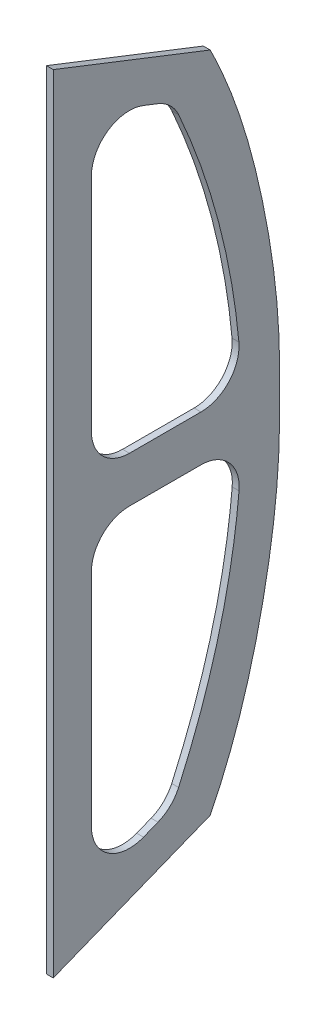
ISO-10303-21;
HEADER;
FILE_DESCRIPTION(('STEP AP214'),'2;1');
FILE_NAME('part.step','',(''),(''),'','','');
FILE_SCHEMA(('AUTOMOTIVE_DESIGN { 1 0 10303 214 1 1 1 1 }'));
ENDSEC;
DATA;
#1=APPLICATION_CONTEXT('core data for automotive mechanical design processes');
#2=APPLICATION_PROTOCOL_DEFINITION('international standard','automotive_design',2000,#1);
#3=PRODUCT_CONTEXT('',#1,'mechanical');
#4=PRODUCT('Part','Part','',(#3));
#5=PRODUCT_RELATED_PRODUCT_CATEGORY('part','',(#4));
#6=PRODUCT_DEFINITION_FORMATION('','',#4);
#7=PRODUCT_DEFINITION_CONTEXT('part definition',#1,'design');
#8=PRODUCT_DEFINITION('design','',#6,#7);
#9=PRODUCT_DEFINITION_SHAPE('','',#8);
#10=(LENGTH_UNIT() NAMED_UNIT(*) SI_UNIT(.MILLI.,.METRE.));
#11=(NAMED_UNIT(*) PLANE_ANGLE_UNIT() SI_UNIT($,.RADIAN.));
#12=(NAMED_UNIT(*) SI_UNIT($,.STERADIAN.) SOLID_ANGLE_UNIT());
#13=UNCERTAINTY_MEASURE_WITH_UNIT(LENGTH_MEASURE(1.E-05),#10,'distance_accuracy_value','');
#14=(GEOMETRIC_REPRESENTATION_CONTEXT(3) GLOBAL_UNCERTAINTY_ASSIGNED_CONTEXT((#13)) GLOBAL_UNIT_ASSIGNED_CONTEXT((#10,
#11,#12)) REPRESENTATION_CONTEXT('',''));
#15=CARTESIAN_POINT('',(0.,0.,0.));
#16=DIRECTION('',(0.,0.,1.));
#17=DIRECTION('',(1.,0.,0.));
#18=AXIS2_PLACEMENT_3D('',#15,#16,#17);
#19=CARTESIAN_POINT('',(9.,0.657149051389639,157.678501295813));
#20=DIRECTION('',(1.,0.,0.));
#21=DIRECTION('',(0.,0.,-1.));
#22=AXIS2_PLACEMENT_3D('',#19,#20,#21);
#23=PLANE('',#22);
#24=CARTESIAN_POINT('',(9.,-434.591306286478,248.999999691598));
#25=CARTESIAN_POINT('',(9.,-426.266385018669,244.812182663864));
#26=CARTESIAN_POINT('',(9.,-409.423964908326,236.801362844897));
#27=CARTESIAN_POINT('',(9.,-375.149628797293,222.212406313021));
#28=CARTESIAN_POINT('',(9.,-331.259297463056,206.472109959754));
#29=CARTESIAN_POINT('',(9.,-277.308218149153,191.065215125894));
#30=CARTESIAN_POINT('',(9.,-222.427655868533,178.618405136148));
#31=CARTESIAN_POINT('',(9.,-167.061884286646,168.601235655821));
#32=CARTESIAN_POINT('',(9.,-120.681496000962,162.664180797077));
#33=CARTESIAN_POINT('',(9.,-83.4660930358459,159.588454430788));
#34=CARTESIAN_POINT('',(9.,-55.5330096837927,158.191016903717));
#35=CARTESIAN_POINT('',(9.,-27.5061419106363,157.699086860232));
#36=CARTESIAN_POINT('',(9.,0.657149051444837,157.668208507846));
#37=CARTESIAN_POINT('',(9.,28.8204400131948,157.699086883261));
#38=CARTESIAN_POINT('',(9.,56.8473077973295,158.191016915326));
#39=CARTESIAN_POINT('',(9.,84.7803911800562,159.588454358424));
#40=CARTESIAN_POINT('',(9.,121.995794186378,162.664180548182));
#41=CARTESIAN_POINT('',(9.,168.376182512208,168.601235151387));
#42=CARTESIAN_POINT('',(9.,223.741954043314,178.618404527818));
#43=CARTESIAN_POINT('',(9.,278.622516156556,191.065214881807));
#44=CARTESIAN_POINT('',(9.,332.573595341031,206.472110197853));
#45=CARTESIAN_POINT('',(9.,376.463926678336,222.212406757595));
#46=CARTESIAN_POINT('',(9.,410.738262920438,236.801363167192));
#47=CARTESIAN_POINT('',(9.,427.580683135124,244.81218279364));
#48=CARTESIAN_POINT('',(9.,435.905604479438,248.999999691598));
#49=B_SPLINE_CURVE_WITH_KNOTS('',3,(#24,#25,#26,#27,#28,#29,#30,#31,#32,#33,#34,#35,#36,#37,#38,
#39,#40,#41,#42,#43,#44,#45,#46,#47,#48),.UNSPECIFIED.,.F.,.F.,(4,1,1,1,1,1,1,1,1,1,1,1,1,1,1,1,
1,1,1,1,1,1,4),(0.00253448303563442,0.0336260778439174,0.0647176726522003,0.126900862268766,
0.189084051885332,0.251267241501898,0.313450431118464,0.37563362073503,0.406725215543313,
0.437816810351596,0.468908405159879,0.499999999968162,0.531091594776445,0.562183189584728,
0.593274784393011,0.624366379201294,0.68654956881786,0.748732758434425,0.810915948050991,
0.873099137667557,0.935282327284123,0.966373922092406,0.997465516900689),.UNSPECIFIED.);
#50=CARTESIAN_POINT('',(9.,-434.591306286478,248.999999691598));
#51=VERTEX_POINT('',#50);
#52=CARTESIAN_POINT('',(9.,435.905604479438,248.999999691598));
#53=VERTEX_POINT('',#52);
#54=EDGE_CURVE('E300',#51,#53,#49,.T.);
#55=ORIENTED_EDGE('',*,*,#54,.T.);
#56=DIRECTION('',(0.,0.364564958016935,0.931177959031522));
#57=VECTOR('',#56,1.);
#58=CARTESIAN_POINT('',(9.,516.556548518137,455.));
#59=LINE('',#58,#57);
#60=CARTESIAN_POINT('',(9.,516.556548518137,455.));
#61=VERTEX_POINT('',#60);
#62=EDGE_CURVE('E306',#53,#61,#59,.T.);
#63=ORIENTED_EDGE('',*,*,#62,.T.);
#64=DIRECTION('',(0.,-1.,0.));
#65=VECTOR('',#64,1.);
#66=CARTESIAN_POINT('',(9.,-516.542644104241,455.));
#67=LINE('',#66,#65);
#68=CARTESIAN_POINT('',(9.,-516.542644104241,455.));
#69=VERTEX_POINT('',#68);
#70=EDGE_CURVE('E312',#61,#69,#67,.T.);
#71=ORIENTED_EDGE('',*,*,#70,.T.);
#72=DIRECTION('',(0.,0.369645440704857,-0.929172883895194));
#73=VECTOR('',#72,1.);
#74=CARTESIAN_POINT('',(9.,-516.542644104241,455.));
#75=LINE('',#74,#73);
#76=EDGE_CURVE('E314',#69,#51,#75,.T.);
#77=ORIENTED_EDGE('',*,*,#76,.T.);
#78=EDGE_LOOP('',(#55,#63,#71,#77));
#79=FACE_BOUND('',#78,.T.);
#80=DIRECTION('',(0.,-1.,0.));
#81=VECTOR('',#80,1.);
#82=CARTESIAN_POINT('',(9.,-369.137843076992,405.));
#83=LINE('',#82,#81);
#84=CARTESIAN_POINT('',(9.,-79.8337801803073,405.));
#85=VERTEX_POINT('',#84);
#86=CARTESIAN_POINT('',(9.,-369.137843076992,405.));
#87=VERTEX_POINT('',#86);
#88=EDGE_CURVE('E396',#85,#87,#83,.T.);
#89=ORIENTED_EDGE('',*,*,#88,.F.);
#90=CARTESIAN_POINT('',(9.,-79.833780180307,355.));
#91=DIRECTION('',(1.,0.,0.));
#92=DIRECTION('',(0.,0.,1.));
#93=AXIS2_PLACEMENT_3D('',#90,#91,#92);
#94=CIRCLE('',#93,50.);
#95=CARTESIAN_POINT('',(9.,-29.8338120251613,354.94356876381));
#96=VERTEX_POINT('',#95);
#97=EDGE_CURVE('E282',#96,#85,#94,.T.);
#98=ORIENTED_EDGE('',*,*,#97,.F.);
#99=DIRECTION('',(0.,0.00112862472380232,0.999999363102914));
#100=VECTOR('',#99,1.);
#101=CARTESIAN_POINT('',(9.,-29.9400790122075,260.787453693892));
#102=LINE('',#101,#100);
#103=CARTESIAN_POINT('',(9.,-29.9400790122075,260.787453693892));
#104=VERTEX_POINT('',#103);
#105=EDGE_CURVE('E251',#104,#96,#102,.T.);
#106=ORIENTED_EDGE('',*,*,#105,.F.);
#107=CARTESIAN_POINT('',(9.,-79.9400471673532,260.843884930082));
#108=DIRECTION('',(1.,0.,0.));
#109=DIRECTION('',(0.,0.,-1.));
#110=AXIS2_PLACEMENT_3D('',#107,#108,#109);
#111=CIRCLE('',#110,50.);
#112=CARTESIAN_POINT('',(9.,-84.5016174452705,211.05239894503));
#113=VERTEX_POINT('',#112);
#114=EDGE_CURVE('E243',#113,#104,#111,.T.);
#115=ORIENTED_EDGE('',*,*,#114,.F.);
#116=CARTESIAN_POINT('',(9.,-382.113233823287,290.4195464928));
#117=CARTESIAN_POINT('',(9.,-336.792856901322,270.011454394464));
#118=CARTESIAN_POINT('',(9.,-238.848455182314,234.431884839498));
#119=CARTESIAN_POINT('',(9.,-138.536584682171,216.002729220171));
#120=CARTESIAN_POINT('',(9.,-84.5016174452705,211.05239894503));
#121=B_SPLINE_CURVE_WITH_KNOTS('',3,(#116,#117,#118,#119,#120),.UNSPECIFIED.,.F.,.F.,(4,1,4),
(0.603422899544501,0.777863990185548,0.976152540413298),.UNSPECIFIED.);
#122=CARTESIAN_POINT('',(9.,-382.113233823287,290.4195464928));
#123=VERTEX_POINT('',#122);
#124=EDGE_CURVE('E237',#123,#113,#121,.T.);
#125=ORIENTED_EDGE('',*,*,#124,.F.);
#126=CARTESIAN_POINT('',(9.,-361.583353584404,336.010379095168));
#127=DIRECTION('',(1.,0.,0.));
#128=DIRECTION('',(0.,0.,-1.));
#129=AXIS2_PLACEMENT_3D('',#126,#127,#128);
#130=CIRCLE('',#129,50.);
#131=CARTESIAN_POINT('',(9.,-408.041997779163,317.528107059925));
#132=VERTEX_POINT('',#131);
#133=EDGE_CURVE('E244',#132,#123,#130,.T.);
#134=ORIENTED_EDGE('',*,*,#133,.F.);
#135=DIRECTION('',(0.,0.369645440704857,-0.929172883895194));
#136=VECTOR('',#135,1.);
#137=CARTESIAN_POINT('',(9.,-415.596487271752,336.517727964757));
#138=LINE('',#137,#136);
#139=CARTESIAN_POINT('',(9.,-415.596487271752,336.517727964757));
#140=VERTEX_POINT('',#139);
#141=EDGE_CURVE('E402',#140,#132,#138,.T.);
#142=ORIENTED_EDGE('',*,*,#141,.F.);
#143=CARTESIAN_POINT('',(9.,-369.137843076993,355.));
#144=DIRECTION('',(1.,0.,0.));
#145=DIRECTION('',(0.,0.,1.));
#146=AXIS2_PLACEMENT_3D('',#143,#144,#145);
#147=CIRCLE('',#146,50.);
#148=EDGE_CURVE('E398',#87,#140,#147,.T.);
#149=ORIENTED_EDGE('',*,*,#148,.F.);
#150=EDGE_LOOP('',(#89,#98,#106,#115,#125,#134,#142,#149));
#151=FACE_BOUND('',#150,.T.);
#152=DIRECTION('',(0.,0.,-1.));
#153=VECTOR('',#152,1.);
#154=CARTESIAN_POINT('',(9.,30.2227200630216,355.));
#155=LINE('',#154,#153);
#156=CARTESIAN_POINT('',(9.,30.2227200630216,355.));
#157=VERTEX_POINT('',#156);
#158=CARTESIAN_POINT('',(9.,30.2227200630216,261.042812551229));
#159=VERTEX_POINT('',#158);
#160=EDGE_CURVE('E179',#157,#159,#155,.T.);
#161=ORIENTED_EDGE('',*,*,#160,.F.);
#162=CARTESIAN_POINT('',(9.,80.2227200630217,355.));
#163=DIRECTION('',(1.,0.,0.));
#164=DIRECTION('',(0.,0.,-1.));
#165=AXIS2_PLACEMENT_3D('',#162,#163,#164);
#166=CIRCLE('',#165,50.);
#167=CARTESIAN_POINT('',(9.,80.222720063022,405.));
#168=VERTEX_POINT('',#167);
#169=EDGE_CURVE('E171',#168,#157,#166,.T.);
#170=ORIENTED_EDGE('',*,*,#169,.F.);
#171=DIRECTION('',(0.,-1.,0.));
#172=VECTOR('',#171,1.);
#173=CARTESIAN_POINT('',(9.,80.222720063022,405.));
#174=LINE('',#173,#172);
#175=CARTESIAN_POINT('',(9.,370.01474683759,405.));
#176=VERTEX_POINT('',#175);
#177=EDGE_CURVE('E572',#176,#168,#174,.T.);
#178=ORIENTED_EDGE('',*,*,#177,.F.);
#179=CARTESIAN_POINT('',(9.,370.01474683759,355.));
#180=DIRECTION('',(1.,0.,0.));
#181=DIRECTION('',(0.,0.,-1.));
#182=AXIS2_PLACEMENT_3D('',#179,#180,#181);
#183=CIRCLE('',#182,50.);
#184=CARTESIAN_POINT('',(9.,416.573644789166,336.771752099153));
#185=VERTEX_POINT('',#184);
#186=EDGE_CURVE('E605',#185,#176,#183,.T.);
#187=ORIENTED_EDGE('',*,*,#186,.F.);
#188=DIRECTION('',(0.,0.364564958016933,0.931177959031523));
#189=VECTOR('',#188,1.);
#190=CARTESIAN_POINT('',(9.,416.573644789166,336.771752099153));
#191=LINE('',#190,#189);
#192=CARTESIAN_POINT('',(9.,409.151966772151,317.815177045793));
#193=VERTEX_POINT('',#192);
#194=EDGE_CURVE('E603',#193,#185,#191,.T.);
#195=ORIENTED_EDGE('',*,*,#194,.F.);
#196=CARTESIAN_POINT('',(9.,362.593068820575,336.043424946639));
#197=DIRECTION('',(1.,0.,0.));
#198=DIRECTION('',(0.,0.,-1.));
#199=AXIS2_PLACEMENT_3D('',#196,#197,#198);
#200=CIRCLE('',#199,50.);
#201=CARTESIAN_POINT('',(9.,382.955736813059,290.37766367818));
#202=VERTEX_POINT('',#201);
#203=EDGE_CURVE('E201',#202,#193,#200,.T.);
#204=ORIENTED_EDGE('',*,*,#203,.F.);
#205=CARTESIAN_POINT('',(9.,84.8674679041338,211.259016819159));
#206=CARTESIAN_POINT('',(9.,139.023424648037,216.31168023043));
#207=CARTESIAN_POINT('',(9.,239.488359394363,234.790316492794));
#208=CARTESIAN_POINT('',(9.,337.596182562006,270.151535440191));
#209=CARTESIAN_POINT('',(9.,382.955736813059,290.37766367818));
#210=B_SPLINE_CURVE_WITH_KNOTS('',3,(#205,#206,#207,#208,#209),.UNSPECIFIED.,.F.,.F.,(4,1,4),
(0.0241884909459258,0.222905391132718,0.397433800373584),.UNSPECIFIED.);
#211=CARTESIAN_POINT('',(9.,84.8674679041338,211.259016819159));
#212=VERTEX_POINT('',#211);
#213=EDGE_CURVE('E194',#212,#202,#210,.T.);
#214=ORIENTED_EDGE('',*,*,#213,.F.);
#215=CARTESIAN_POINT('',(9.,80.2227200630216,261.042812551229));
#216=DIRECTION('',(1.,0.,0.));
#217=DIRECTION('',(0.,0.,1.));
#218=AXIS2_PLACEMENT_3D('',#215,#216,#217);
#219=CIRCLE('',#218,50.);
#220=EDGE_CURVE('E192',#159,#212,#219,.T.);
#221=ORIENTED_EDGE('',*,*,#220,.F.);
#222=EDGE_LOOP('',(#161,#170,#178,#187,#195,#204,#214,#221));
#223=FACE_BOUND('',#222,.T.);
#224=ADVANCED_FACE('F33',(#79,#151,#223),#23,.T.);
#225=CARTESIAN_POINT('',(0.,0.657149051389639,157.678501295813));
#226=DIRECTION('',(1.,0.,0.));
#227=DIRECTION('',(0.,0.,-1.));
#228=AXIS2_PLACEMENT_3D('',#225,#226,#227);
#229=PLANE('',#228);
#230=CARTESIAN_POINT('',(0.,-79.833780180307,355.));
#231=DIRECTION('',(1.,0.,0.));
#232=DIRECTION('',(0.,0.,1.));
#233=AXIS2_PLACEMENT_3D('',#230,#231,#232);
#234=CIRCLE('',#233,50.);
#235=CARTESIAN_POINT('',(0.,-29.8338120251613,354.943568763809));
#236=VERTEX_POINT('',#235);
#237=CARTESIAN_POINT('',(0.,-79.8337801803073,405.));
#238=VERTEX_POINT('',#237);
#239=EDGE_CURVE('E187',#236,#238,#234,.T.);
#240=ORIENTED_EDGE('',*,*,#239,.T.);
#241=DIRECTION('',(0.,-1.,0.));
#242=VECTOR('',#241,1.);
#243=CARTESIAN_POINT('',(0.,-369.137843076992,405.));
#244=LINE('',#243,#242);
#245=CARTESIAN_POINT('',(0.,-369.137843076992,405.));
#246=VERTEX_POINT('',#245);
#247=EDGE_CURVE('E256',#238,#246,#244,.T.);
#248=ORIENTED_EDGE('',*,*,#247,.T.);
#249=CARTESIAN_POINT('',(0.,-369.137843076993,355.));
#250=DIRECTION('',(1.,0.,0.));
#251=DIRECTION('',(0.,0.,1.));
#252=AXIS2_PLACEMENT_3D('',#249,#250,#251);
#253=CIRCLE('',#252,50.);
#254=CARTESIAN_POINT('',(0.,-415.596487271752,336.517727964757));
#255=VERTEX_POINT('',#254);
#256=EDGE_CURVE('E259',#246,#255,#253,.T.);
#257=ORIENTED_EDGE('',*,*,#256,.T.);
#258=DIRECTION('',(0.,0.369645440704857,-0.929172883895194));
#259=VECTOR('',#258,1.);
#260=CARTESIAN_POINT('',(0.,-415.596487271752,336.517727964757));
#261=LINE('',#260,#259);
#262=CARTESIAN_POINT('',(0.,-408.041997779163,317.528107059925));
#263=VERTEX_POINT('',#262);
#264=EDGE_CURVE('E262',#255,#263,#261,.T.);
#265=ORIENTED_EDGE('',*,*,#264,.T.);
#266=CARTESIAN_POINT('',(0.,-361.583353584404,336.010379095168));
#267=DIRECTION('',(1.,0.,0.));
#268=DIRECTION('',(0.,0.,-1.));
#269=AXIS2_PLACEMENT_3D('',#266,#267,#268);
#270=CIRCLE('',#269,50.);
#271=CARTESIAN_POINT('',(0.,-382.113233823287,290.4195464928));
#272=VERTEX_POINT('',#271);
#273=EDGE_CURVE('E265',#263,#272,#270,.T.);
#274=ORIENTED_EDGE('',*,*,#273,.T.);
#275=CARTESIAN_POINT('',(0.,-382.113233823287,290.4195464928));
#276=CARTESIAN_POINT('',(0.,-336.792856901322,270.011454394464));
#277=CARTESIAN_POINT('',(0.,-238.848455182314,234.431884839498));
#278=CARTESIAN_POINT('',(0.,-138.536584682171,216.002729220171));
#279=CARTESIAN_POINT('',(0.,-84.5016174452705,211.05239894503));
#280=B_SPLINE_CURVE_WITH_KNOTS('',3,(#275,#276,#277,#278,#279),.UNSPECIFIED.,.F.,.F.,(4,1,4),
(0.603422899544501,0.777863990185548,0.976152540413298),.UNSPECIFIED.);
#281=CARTESIAN_POINT('',(0.,-84.5016174452705,211.05239894503));
#282=VERTEX_POINT('',#281);
#283=EDGE_CURVE('E268',#272,#282,#280,.T.);
#284=ORIENTED_EDGE('',*,*,#283,.T.);
#285=CARTESIAN_POINT('',(0.,-79.9400471673532,260.843884930082));
#286=DIRECTION('',(1.,0.,0.));
#287=DIRECTION('',(0.,0.,-1.));
#288=AXIS2_PLACEMENT_3D('',#285,#286,#287);
#289=CIRCLE('',#288,50.);
#290=CARTESIAN_POINT('',(0.,-29.9400790122076,260.787453693892));
#291=VERTEX_POINT('',#290);
#292=EDGE_CURVE('E273',#282,#291,#289,.T.);
#293=ORIENTED_EDGE('',*,*,#292,.T.);
#294=DIRECTION('',(0.,0.00112862472380232,0.999999363102914));
#295=VECTOR('',#294,1.);
#296=CARTESIAN_POINT('',(0.,-29.9400790122075,260.787453693892));
#297=LINE('',#296,#295);
#298=EDGE_CURVE('E279',#291,#236,#297,.T.);
#299=ORIENTED_EDGE('',*,*,#298,.T.);
#300=EDGE_LOOP('',(#240,#248,#257,#265,#274,#284,#293,#299));
#301=FACE_BOUND('',#300,.T.);
#302=CARTESIAN_POINT('',(0.,-434.591306286478,248.999999691598));
#303=CARTESIAN_POINT('',(0.,-426.266385018669,244.812182663864));
#304=CARTESIAN_POINT('',(0.,-409.423964908326,236.801362844897));
#305=CARTESIAN_POINT('',(0.,-375.149628797293,222.212406313021));
#306=CARTESIAN_POINT('',(0.,-331.259297463056,206.472109959754));
#307=CARTESIAN_POINT('',(0.,-277.308218149153,191.065215125894));
#308=CARTESIAN_POINT('',(0.,-222.427655868533,178.618405136148));
#309=CARTESIAN_POINT('',(0.,-167.061884286646,168.601235655821));
#310=CARTESIAN_POINT('',(0.,-120.681496000962,162.664180797077));
#311=CARTESIAN_POINT('',(0.,-83.4660930358459,159.588454430788));
#312=CARTESIAN_POINT('',(0.,-55.5330096837927,158.191016903717));
#313=CARTESIAN_POINT('',(0.,-27.5061419106363,157.699086860232));
#314=CARTESIAN_POINT('',(0.,0.657149051444837,157.668208507846));
#315=CARTESIAN_POINT('',(0.,28.8204400131948,157.699086883261));
#316=CARTESIAN_POINT('',(0.,56.8473077973295,158.191016915326));
#317=CARTESIAN_POINT('',(0.,84.7803911800562,159.588454358424));
#318=CARTESIAN_POINT('',(0.,121.995794186378,162.664180548182));
#319=CARTESIAN_POINT('',(0.,168.376182512208,168.601235151387));
#320=CARTESIAN_POINT('',(0.,223.741954043314,178.618404527818));
#321=CARTESIAN_POINT('',(0.,278.622516156556,191.065214881807));
#322=CARTESIAN_POINT('',(0.,332.573595341031,206.472110197853));
#323=CARTESIAN_POINT('',(0.,376.463926678336,222.212406757595));
#324=CARTESIAN_POINT('',(0.,410.738262920438,236.801363167192));
#325=CARTESIAN_POINT('',(0.,427.580683135124,244.81218279364));
#326=CARTESIAN_POINT('',(0.,435.905604479438,248.999999691598));
#327=B_SPLINE_CURVE_WITH_KNOTS('',3,(#302,#303,#304,#305,#306,#307,#308,#309,#310,#311,#312,
#313,#314,#315,#316,#317,#318,#319,#320,#321,#322,#323,#324,#325,#326),.UNSPECIFIED.,.F.,.F.,(4,
1,1,1,1,1,1,1,1,1,1,1,1,1,1,1,1,1,1,1,1,1,4),(0.00253448303563442,0.0336260778439174,
0.0647176726522003,0.126900862268766,0.189084051885332,0.251267241501898,0.313450431118464,
0.37563362073503,0.406725215543313,0.437816810351596,0.468908405159879,0.499999999968162,
0.531091594776445,0.562183189584728,0.593274784393011,0.624366379201294,0.68654956881786,
0.748732758434425,0.810915948050991,0.873099137667557,0.935282327284123,0.966373922092406,
0.997465516900689),.UNSPECIFIED.);
#328=CARTESIAN_POINT('',(0.,-434.591306286478,248.999999691598));
#329=VERTEX_POINT('',#328);
#330=CARTESIAN_POINT('',(0.,435.905604479438,248.999999691598));
#331=VERTEX_POINT('',#330);
#332=EDGE_CURVE('E299',#329,#331,#327,.T.);
#333=ORIENTED_EDGE('',*,*,#332,.F.);
#334=DIRECTION('',(0.,0.369645440704857,-0.929172883895194));
#335=VECTOR('',#334,1.);
#336=CARTESIAN_POINT('',(0.,-516.542644104241,455.));
#337=LINE('',#336,#335);
#338=CARTESIAN_POINT('',(0.,-516.542644104241,455.));
#339=VERTEX_POINT('',#338);
#340=EDGE_CURVE('E307',#339,#329,#337,.T.);
#341=ORIENTED_EDGE('',*,*,#340,.F.);
#342=DIRECTION('',(0.,-1.,0.));
#343=VECTOR('',#342,1.);
#344=CARTESIAN_POINT('',(0.,-516.542644104241,455.));
#345=LINE('',#344,#343);
#346=CARTESIAN_POINT('',(0.,516.556548518137,455.));
#347=VERTEX_POINT('',#346);
#348=EDGE_CURVE('E326',#347,#339,#345,.T.);
#349=ORIENTED_EDGE('',*,*,#348,.F.);
#350=DIRECTION('',(0.,0.364564958016935,0.931177959031522));
#351=VECTOR('',#350,1.);
#352=CARTESIAN_POINT('',(0.,516.556548518137,455.));
#353=LINE('',#352,#351);
#354=EDGE_CURVE('E321',#331,#347,#353,.T.);
#355=ORIENTED_EDGE('',*,*,#354,.F.);
#356=EDGE_LOOP('',(#333,#341,#349,#355));
#357=FACE_BOUND('',#356,.T.);
#358=CARTESIAN_POINT('',(0.,80.2227200630217,355.));
#359=DIRECTION('',(1.,0.,0.));
#360=DIRECTION('',(0.,0.,-1.));
#361=AXIS2_PLACEMENT_3D('',#358,#359,#360);
#362=CIRCLE('',#361,50.);
#363=CARTESIAN_POINT('',(0.,80.222720063022,405.));
#364=VERTEX_POINT('',#363);
#365=CARTESIAN_POINT('',(0.,30.2227200630216,355.));
#366=VERTEX_POINT('',#365);
#367=EDGE_CURVE('E57',#364,#366,#362,.T.);
#368=ORIENTED_EDGE('',*,*,#367,.T.);
#369=DIRECTION('',(0.,0.,-1.));
#370=VECTOR('',#369,1.);
#371=CARTESIAN_POINT('',(0.,30.2227200630216,355.));
#372=LINE('',#371,#370);
#373=CARTESIAN_POINT('',(0.,30.2227200630216,261.042812551229));
#374=VERTEX_POINT('',#373);
#375=EDGE_CURVE('E186',#366,#374,#372,.T.);
#376=ORIENTED_EDGE('',*,*,#375,.T.);
#377=CARTESIAN_POINT('',(0.,80.2227200630216,261.042812551229));
#378=DIRECTION('',(1.,0.,0.));
#379=DIRECTION('',(0.,0.,1.));
#380=AXIS2_PLACEMENT_3D('',#377,#378,#379);
#381=CIRCLE('',#380,50.);
#382=CARTESIAN_POINT('',(0.,84.8674679041338,211.259016819159));
#383=VERTEX_POINT('',#382);
#384=EDGE_CURVE('E583',#374,#383,#381,.T.);
#385=ORIENTED_EDGE('',*,*,#384,.T.);
#386=CARTESIAN_POINT('',(0.,84.8674679041338,211.259016819159));
#387=CARTESIAN_POINT('',(0.,139.023424648037,216.31168023043));
#388=CARTESIAN_POINT('',(0.,239.488359394363,234.790316492794));
#389=CARTESIAN_POINT('',(0.,337.596182562006,270.151535440191));
#390=CARTESIAN_POINT('',(0.,382.955736813059,290.37766367818));
#391=B_SPLINE_CURVE_WITH_KNOTS('',3,(#386,#387,#388,#389,#390),.UNSPECIFIED.,.F.,.F.,(4,1,4),
(0.0241884909459258,0.222905391132718,0.397433800373584),.UNSPECIFIED.);
#392=CARTESIAN_POINT('',(0.,382.955736813059,290.37766367818));
#393=VERTEX_POINT('',#392);
#394=EDGE_CURVE('E587',#383,#393,#391,.T.);
#395=ORIENTED_EDGE('',*,*,#394,.T.);
#396=CARTESIAN_POINT('',(0.,362.593068820575,336.043424946639));
#397=DIRECTION('',(1.,0.,0.));
#398=DIRECTION('',(0.,0.,-1.));
#399=AXIS2_PLACEMENT_3D('',#396,#397,#398);
#400=CIRCLE('',#399,50.);
#401=CARTESIAN_POINT('',(0.,409.151966772151,317.815177045793));
#402=VERTEX_POINT('',#401);
#403=EDGE_CURVE('E567',#393,#402,#400,.T.);
#404=ORIENTED_EDGE('',*,*,#403,.T.);
#405=DIRECTION('',(0.,0.364564958016933,0.931177959031523));
#406=VECTOR('',#405,1.);
#407=CARTESIAN_POINT('',(0.,416.573644789166,336.771752099153));
#408=LINE('',#407,#406);
#409=CARTESIAN_POINT('',(0.,416.573644789166,336.771752099153));
#410=VERTEX_POINT('',#409);
#411=EDGE_CURVE('E564',#402,#410,#408,.T.);
#412=ORIENTED_EDGE('',*,*,#411,.T.);
#413=CARTESIAN_POINT('',(0.,370.01474683759,355.));
#414=DIRECTION('',(1.,0.,0.));
#415=DIRECTION('',(0.,0.,-1.));
#416=AXIS2_PLACEMENT_3D('',#413,#414,#415);
#417=CIRCLE('',#416,50.);
#418=CARTESIAN_POINT('',(0.,370.01474683759,405.));
#419=VERTEX_POINT('',#418);
#420=EDGE_CURVE('E558',#410,#419,#417,.T.);
#421=ORIENTED_EDGE('',*,*,#420,.T.);
#422=DIRECTION('',(0.,-1.,0.));
#423=VECTOR('',#422,1.);
#424=CARTESIAN_POINT('',(0.,80.222720063022,405.));
#425=LINE('',#424,#423);
#426=EDGE_CURVE('E180',#419,#364,#425,.T.);
#427=ORIENTED_EDGE('',*,*,#426,.T.);
#428=EDGE_LOOP('',(#368,#376,#385,#395,#404,#412,#421,#427));
#429=FACE_BOUND('',#428,.T.);
#430=ADVANCED_FACE('F344',(#301,#357,#429),#229,.F.);
#431=DIRECTION('',(-1.,0.,0.));
#432=VECTOR('',#431,1.);
#433=SURFACE_OF_LINEAR_EXTRUSION('',#49,#432);
#434=ORIENTED_EDGE('',*,*,#332,.T.);
#435=DIRECTION('',(-1.,0.,0.));
#436=VECTOR('',#435,1.);
#437=CARTESIAN_POINT('',(9.,435.905604479438,248.999999691598));
#438=LINE('',#437,#436);
#439=EDGE_CURVE('E11',#53,#331,#438,.T.);
#440=ORIENTED_EDGE('',*,*,#439,.F.);
#441=ORIENTED_EDGE('',*,*,#54,.F.);
#442=DIRECTION('',(-1.,0.,0.));
#443=VECTOR('',#442,1.);
#444=CARTESIAN_POINT('',(9.,-434.591306286478,248.999999691598));
#445=LINE('',#444,#443);
#446=EDGE_CURVE('E316',#51,#329,#445,.T.);
#447=ORIENTED_EDGE('',*,*,#446,.T.);
#448=EDGE_LOOP('',(#434,#440,#441,#447));
#449=FACE_BOUND('',#448,.T.);
#450=ADVANCED_FACE('F35',(#449),#433,.F.);
#451=CARTESIAN_POINT('',(9.,516.556548518137,455.));
#452=DIRECTION('',(0.,-0.931177959031522,0.364564958016935));
#453=DIRECTION('',(0.,-0.364564958016935,-0.931177959031522));
#454=AXIS2_PLACEMENT_3D('',#451,#452,#453);
#455=PLANE('',#454);
#456=ORIENTED_EDGE('',*,*,#354,.T.);
#457=DIRECTION('',(-1.,0.,0.));
#458=VECTOR('',#457,1.);
#459=CARTESIAN_POINT('',(9.,516.556548518137,455.));
#460=LINE('',#459,#458);
#461=EDGE_CURVE('E42',#61,#347,#460,.T.);
#462=ORIENTED_EDGE('',*,*,#461,.F.);
#463=ORIENTED_EDGE('',*,*,#62,.F.);
#464=ORIENTED_EDGE('',*,*,#439,.T.);
#465=EDGE_LOOP('',(#456,#462,#463,#464));
#466=FACE_BOUND('',#465,.T.);
#467=ADVANCED_FACE('F355',(#466),#455,.F.);
#468=CARTESIAN_POINT('',(9.,-516.542644104241,455.));
#469=DIRECTION('',(0.,0.,-1.));
#470=DIRECTION('',(0.,1.,0.));
#471=AXIS2_PLACEMENT_3D('',#468,#469,#470);
#472=PLANE('',#471);
#473=ORIENTED_EDGE('',*,*,#348,.T.);
#474=DIRECTION('',(-1.,0.,0.));
#475=VECTOR('',#474,1.);
#476=CARTESIAN_POINT('',(9.,-516.542644104241,455.));
#477=LINE('',#476,#475);
#478=EDGE_CURVE('E331',#69,#339,#477,.T.);
#479=ORIENTED_EDGE('',*,*,#478,.F.);
#480=ORIENTED_EDGE('',*,*,#70,.F.);
#481=ORIENTED_EDGE('',*,*,#461,.T.);
#482=EDGE_LOOP('',(#473,#479,#480,#481));
#483=FACE_BOUND('',#482,.T.);
#484=ADVANCED_FACE('F338',(#483),#472,.F.);
#485=CARTESIAN_POINT('',(9.,-516.542644104241,455.));
#486=DIRECTION('',(0.,0.929172883895194,0.369645440704857));
#487=DIRECTION('',(0.,-0.369645440704857,0.929172883895194));
#488=AXIS2_PLACEMENT_3D('',#485,#486,#487);
#489=PLANE('',#488);
#490=ORIENTED_EDGE('',*,*,#340,.T.);
#491=ORIENTED_EDGE('',*,*,#446,.F.);
#492=ORIENTED_EDGE('',*,*,#76,.F.);
#493=ORIENTED_EDGE('',*,*,#478,.T.);
#494=EDGE_LOOP('',(#490,#491,#492,#493));
#495=FACE_BOUND('',#494,.T.);
#496=ADVANCED_FACE('F348',(#495),#489,.F.);
#497=CARTESIAN_POINT('',(9.,-79.833780180307,355.));
#498=DIRECTION('',(-1.,0.,0.));
#499=DIRECTION('',(0.,0.,1.));
#500=AXIS2_PLACEMENT_3D('',#497,#498,#499);
#501=CYLINDRICAL_SURFACE('',#500,50.);
#502=ORIENTED_EDGE('',*,*,#239,.F.);
#503=DIRECTION('',(-1.,0.,0.));
#504=VECTOR('',#503,1.);
#505=CARTESIAN_POINT('',(9.,-29.8338120251613,354.94356876381));
#506=LINE('',#505,#504);
#507=EDGE_CURVE('E253',#96,#236,#506,.T.);
#508=ORIENTED_EDGE('',*,*,#507,.F.);
#509=ORIENTED_EDGE('',*,*,#97,.T.);
#510=DIRECTION('',(-1.,0.,0.));
#511=VECTOR('',#510,1.);
#512=CARTESIAN_POINT('',(9.,-79.8337801803073,405.));
#513=LINE('',#512,#511);
#514=EDGE_CURVE('E297',#85,#238,#513,.T.);
#515=ORIENTED_EDGE('',*,*,#514,.T.);
#516=EDGE_LOOP('',(#502,#508,#509,#515));
#517=FACE_BOUND('',#516,.T.);
#518=ADVANCED_FACE('F370',(#517),#501,.F.);
#519=CARTESIAN_POINT('',(9.,-369.137843076992,405.));
#520=DIRECTION('',(0.,0.,-1.));
#521=DIRECTION('',(-1.,0.,0.));
#522=AXIS2_PLACEMENT_3D('',#519,#520,#521);
#523=PLANE('',#522);
#524=ORIENTED_EDGE('',*,*,#247,.F.);
#525=ORIENTED_EDGE('',*,*,#514,.F.);
#526=ORIENTED_EDGE('',*,*,#88,.T.);
#527=DIRECTION('',(-1.,0.,0.));
#528=VECTOR('',#527,1.);
#529=CARTESIAN_POINT('',(9.,-369.137843076992,405.));
#530=LINE('',#529,#528);
#531=EDGE_CURVE('E295',#87,#246,#530,.T.);
#532=ORIENTED_EDGE('',*,*,#531,.T.);
#533=EDGE_LOOP('',(#524,#525,#526,#532));
#534=FACE_BOUND('',#533,.T.);
#535=ADVANCED_FACE('F377',(#534),#523,.T.);
#536=CARTESIAN_POINT('',(9.,-369.137843076993,355.));
#537=DIRECTION('',(-1.,0.,0.));
#538=DIRECTION('',(0.,0.,1.));
#539=AXIS2_PLACEMENT_3D('',#536,#537,#538);
#540=CYLINDRICAL_SURFACE('',#539,50.);
#541=ORIENTED_EDGE('',*,*,#256,.F.);
#542=ORIENTED_EDGE('',*,*,#531,.F.);
#543=ORIENTED_EDGE('',*,*,#148,.T.);
#544=DIRECTION('',(-1.,0.,0.));
#545=VECTOR('',#544,1.);
#546=CARTESIAN_POINT('',(9.,-415.596487271752,336.517727964757));
#547=LINE('',#546,#545);
#548=EDGE_CURVE('E293',#140,#255,#547,.T.);
#549=ORIENTED_EDGE('',*,*,#548,.T.);
#550=EDGE_LOOP('',(#541,#542,#543,#549));
#551=FACE_BOUND('',#550,.T.);
#552=ADVANCED_FACE('F382',(#551),#540,.F.);
#553=CARTESIAN_POINT('',(9.,-415.596487271752,336.517727964757));
#554=DIRECTION('',(0.,0.929172883895194,0.369645440704857));
#555=DIRECTION('',(0.,-0.369645440704857,0.929172883895194));
#556=AXIS2_PLACEMENT_3D('',#553,#554,#555);
#557=PLANE('',#556);
#558=ORIENTED_EDGE('',*,*,#264,.F.);
#559=ORIENTED_EDGE('',*,*,#548,.F.);
#560=ORIENTED_EDGE('',*,*,#141,.T.);
#561=DIRECTION('',(-1.,0.,0.));
#562=VECTOR('',#561,1.);
#563=CARTESIAN_POINT('',(9.,-408.041997779163,317.528107059925));
#564=LINE('',#563,#562);
#565=EDGE_CURVE('E291',#132,#263,#564,.T.);
#566=ORIENTED_EDGE('',*,*,#565,.T.);
#567=EDGE_LOOP('',(#558,#559,#560,#566));
#568=FACE_BOUND('',#567,.T.);
#569=ADVANCED_FACE('F413',(#568),#557,.T.);
#570=CARTESIAN_POINT('',(9.,-361.583353584404,336.010379095168));
#571=DIRECTION('',(-1.,0.,0.));
#572=DIRECTION('',(0.,0.,1.));
#573=AXIS2_PLACEMENT_3D('',#570,#571,#572);
#574=CYLINDRICAL_SURFACE('',#573,50.);
#575=ORIENTED_EDGE('',*,*,#273,.F.);
#576=ORIENTED_EDGE('',*,*,#565,.F.);
#577=ORIENTED_EDGE('',*,*,#133,.T.);
#578=DIRECTION('',(-1.,0.,0.));
#579=VECTOR('',#578,1.);
#580=CARTESIAN_POINT('',(9.,-382.113233823287,290.4195464928));
#581=LINE('',#580,#579);
#582=EDGE_CURVE('E289',#123,#272,#581,.T.);
#583=ORIENTED_EDGE('',*,*,#582,.T.);
#584=EDGE_LOOP('',(#575,#576,#577,#583));
#585=FACE_BOUND('',#584,.T.);
#586=ADVANCED_FACE('F234',(#585),#574,.F.);
#587=DIRECTION('',(-1.,0.,0.));
#588=VECTOR('',#587,1.);
#589=SURFACE_OF_LINEAR_EXTRUSION('',#121,#588);
#590=ORIENTED_EDGE('',*,*,#283,.F.);
#591=ORIENTED_EDGE('',*,*,#582,.F.);
#592=ORIENTED_EDGE('',*,*,#124,.T.);
#593=DIRECTION('',(-1.,0.,0.));
#594=VECTOR('',#593,1.);
#595=CARTESIAN_POINT('',(9.,-84.5016174452705,211.05239894503));
#596=LINE('',#595,#594);
#597=EDGE_CURVE('E287',#113,#282,#596,.T.);
#598=ORIENTED_EDGE('',*,*,#597,.T.);
#599=EDGE_LOOP('',(#590,#591,#592,#598));
#600=FACE_BOUND('',#599,.T.);
#601=ADVANCED_FACE('F229',(#600),#589,.T.);
#602=CARTESIAN_POINT('',(9.,-79.9400471673532,260.843884930082));
#603=DIRECTION('',(-1.,0.,0.));
#604=DIRECTION('',(0.,0.,1.));
#605=AXIS2_PLACEMENT_3D('',#602,#603,#604);
#606=CYLINDRICAL_SURFACE('',#605,50.);
#607=ORIENTED_EDGE('',*,*,#292,.F.);
#608=ORIENTED_EDGE('',*,*,#597,.F.);
#609=ORIENTED_EDGE('',*,*,#114,.T.);
#610=DIRECTION('',(-1.,0.,0.));
#611=VECTOR('',#610,1.);
#612=CARTESIAN_POINT('',(9.,-29.9400790122076,260.787453693892));
#613=LINE('',#612,#611);
#614=EDGE_CURVE('E285',#104,#291,#613,.T.);
#615=ORIENTED_EDGE('',*,*,#614,.T.);
#616=EDGE_LOOP('',(#607,#608,#609,#615));
#617=FACE_BOUND('',#616,.T.);
#618=ADVANCED_FACE('F225',(#617),#606,.F.);
#619=CARTESIAN_POINT('',(9.,-29.9400790122075,260.787453693892));
#620=DIRECTION('',(0.,-0.999999363102914,0.00112862472380232));
#621=DIRECTION('',(0.,-0.00112862472380232,-0.999999363102914));
#622=AXIS2_PLACEMENT_3D('',#619,#620,#621);
#623=PLANE('',#622);
#624=ORIENTED_EDGE('',*,*,#298,.F.);
#625=ORIENTED_EDGE('',*,*,#614,.F.);
#626=ORIENTED_EDGE('',*,*,#105,.T.);
#627=ORIENTED_EDGE('',*,*,#507,.T.);
#628=EDGE_LOOP('',(#624,#625,#626,#627));
#629=FACE_BOUND('',#628,.T.);
#630=ADVANCED_FACE('F222',(#629),#623,.T.);
#631=CARTESIAN_POINT('',(9.,80.2227200630217,355.));
#632=DIRECTION('',(-1.,0.,0.));
#633=DIRECTION('',(0.,0.,1.));
#634=AXIS2_PLACEMENT_3D('',#631,#632,#633);
#635=CYLINDRICAL_SURFACE('',#634,50.);
#636=ORIENTED_EDGE('',*,*,#367,.F.);
#637=DIRECTION('',(-1.,0.,0.));
#638=VECTOR('',#637,1.);
#639=CARTESIAN_POINT('',(9.,80.222720063022,405.));
#640=LINE('',#639,#638);
#641=EDGE_CURVE('E175',#168,#364,#640,.T.);
#642=ORIENTED_EDGE('',*,*,#641,.F.);
#643=ORIENTED_EDGE('',*,*,#169,.T.);
#644=DIRECTION('',(-1.,0.,0.));
#645=VECTOR('',#644,1.);
#646=CARTESIAN_POINT('',(9.,30.2227200630216,355.));
#647=LINE('',#646,#645);
#648=EDGE_CURVE('E174',#157,#366,#647,.T.);
#649=ORIENTED_EDGE('',*,*,#648,.T.);
#650=EDGE_LOOP('',(#636,#642,#643,#649));
#651=FACE_BOUND('',#650,.T.);
#652=ADVANCED_FACE('F173',(#651),#635,.F.);
#653=CARTESIAN_POINT('',(9.,30.2227200630216,355.));
#654=DIRECTION('',(0.,1.,0.));
#655=DIRECTION('',(0.,0.,1.));
#656=AXIS2_PLACEMENT_3D('',#653,#654,#655);
#657=PLANE('',#656);
#658=ORIENTED_EDGE('',*,*,#375,.F.);
#659=ORIENTED_EDGE('',*,*,#648,.F.);
#660=ORIENTED_EDGE('',*,*,#160,.T.);
#661=DIRECTION('',(-1.,0.,0.));
#662=VECTOR('',#661,1.);
#663=CARTESIAN_POINT('',(9.,30.2227200630216,261.042812551229));
#664=LINE('',#663,#662);
#665=EDGE_CURVE('E188',#159,#374,#664,.T.);
#666=ORIENTED_EDGE('',*,*,#665,.T.);
#667=EDGE_LOOP('',(#658,#659,#660,#666));
#668=FACE_BOUND('',#667,.T.);
#669=ADVANCED_FACE('F183',(#668),#657,.T.);
#670=CARTESIAN_POINT('',(9.,80.2227200630216,261.042812551229));
#671=DIRECTION('',(-1.,0.,0.));
#672=DIRECTION('',(0.,0.,1.));
#673=AXIS2_PLACEMENT_3D('',#670,#671,#672);
#674=CYLINDRICAL_SURFACE('',#673,50.);
#675=ORIENTED_EDGE('',*,*,#384,.F.);
#676=ORIENTED_EDGE('',*,*,#665,.F.);
#677=ORIENTED_EDGE('',*,*,#220,.T.);
#678=DIRECTION('',(-1.,0.,0.));
#679=VECTOR('',#678,1.);
#680=CARTESIAN_POINT('',(9.,84.8674679041338,211.259016819159));
#681=LINE('',#680,#679);
#682=EDGE_CURVE('E580',#212,#383,#681,.T.);
#683=ORIENTED_EDGE('',*,*,#682,.T.);
#684=EDGE_LOOP('',(#675,#676,#677,#683));
#685=FACE_BOUND('',#684,.T.);
#686=ADVANCED_FACE('F212',(#685),#674,.F.);
#687=DIRECTION('',(-1.,0.,0.));
#688=VECTOR('',#687,1.);
#689=SURFACE_OF_LINEAR_EXTRUSION('',#210,#688);
#690=ORIENTED_EDGE('',*,*,#394,.F.);
#691=ORIENTED_EDGE('',*,*,#682,.F.);
#692=ORIENTED_EDGE('',*,*,#213,.T.);
#693=DIRECTION('',(-1.,0.,0.));
#694=VECTOR('',#693,1.);
#695=CARTESIAN_POINT('',(9.,382.955736813059,290.37766367818));
#696=LINE('',#695,#694);
#697=EDGE_CURVE('E578',#202,#393,#696,.T.);
#698=ORIENTED_EDGE('',*,*,#697,.T.);
#699=EDGE_LOOP('',(#690,#691,#692,#698));
#700=FACE_BOUND('',#699,.T.);
#701=ADVANCED_FACE('F207',(#700),#689,.T.);
#702=CARTESIAN_POINT('',(9.,362.593068820575,336.043424946639));
#703=DIRECTION('',(-1.,0.,0.));
#704=DIRECTION('',(0.,0.,1.));
#705=AXIS2_PLACEMENT_3D('',#702,#703,#704);
#706=CYLINDRICAL_SURFACE('',#705,50.);
#707=ORIENTED_EDGE('',*,*,#403,.F.);
#708=ORIENTED_EDGE('',*,*,#697,.F.);
#709=ORIENTED_EDGE('',*,*,#203,.T.);
#710=DIRECTION('',(-1.,0.,0.));
#711=VECTOR('',#710,1.);
#712=CARTESIAN_POINT('',(9.,409.151966772151,317.815177045793));
#713=LINE('',#712,#711);
#714=EDGE_CURVE('E576',#193,#402,#713,.T.);
#715=ORIENTED_EDGE('',*,*,#714,.T.);
#716=EDGE_LOOP('',(#707,#708,#709,#715));
#717=FACE_BOUND('',#716,.T.);
#718=ADVANCED_FACE('F211',(#717),#706,.F.);
#719=CARTESIAN_POINT('',(9.,416.573644789166,336.771752099153));
#720=DIRECTION('',(0.,-0.931177959031522,0.364564958016933));
#721=DIRECTION('',(0.,-0.364564958016933,-0.931177959031523));
#722=AXIS2_PLACEMENT_3D('',#719,#720,#721);
#723=PLANE('',#722);
#724=ORIENTED_EDGE('',*,*,#411,.F.);
#725=ORIENTED_EDGE('',*,*,#714,.F.);
#726=ORIENTED_EDGE('',*,*,#194,.T.);
#727=DIRECTION('',(-1.,0.,0.));
#728=VECTOR('',#727,1.);
#729=CARTESIAN_POINT('',(9.,416.573644789166,336.771752099153));
#730=LINE('',#729,#728);
#731=EDGE_CURVE('E574',#185,#410,#730,.T.);
#732=ORIENTED_EDGE('',*,*,#731,.T.);
#733=EDGE_LOOP('',(#724,#725,#726,#732));
#734=FACE_BOUND('',#733,.T.);
#735=ADVANCED_FACE('F460',(#734),#723,.T.);
#736=CARTESIAN_POINT('',(9.,370.01474683759,355.));
#737=DIRECTION('',(-1.,0.,0.));
#738=DIRECTION('',(0.,0.,1.));
#739=AXIS2_PLACEMENT_3D('',#736,#737,#738);
#740=CYLINDRICAL_SURFACE('',#739,50.);
#741=ORIENTED_EDGE('',*,*,#420,.F.);
#742=ORIENTED_EDGE('',*,*,#731,.F.);
#743=ORIENTED_EDGE('',*,*,#186,.T.);
#744=DIRECTION('',(-1.,0.,0.));
#745=VECTOR('',#744,1.);
#746=CARTESIAN_POINT('',(9.,370.01474683759,405.));
#747=LINE('',#746,#745);
#748=EDGE_CURVE('E49',#176,#419,#747,.T.);
#749=ORIENTED_EDGE('',*,*,#748,.T.);
#750=EDGE_LOOP('',(#741,#742,#743,#749));
#751=FACE_BOUND('',#750,.T.);
#752=ADVANCED_FACE('F467',(#751),#740,.F.);
#753=CARTESIAN_POINT('',(9.,80.222720063022,405.));
#754=DIRECTION('',(0.,0.,-1.));
#755=DIRECTION('',(-1.,0.,0.));
#756=AXIS2_PLACEMENT_3D('',#753,#754,#755);
#757=PLANE('',#756);
#758=ORIENTED_EDGE('',*,*,#426,.F.);
#759=ORIENTED_EDGE('',*,*,#748,.F.);
#760=ORIENTED_EDGE('',*,*,#177,.T.);
#761=ORIENTED_EDGE('',*,*,#641,.T.);
#762=EDGE_LOOP('',(#758,#759,#760,#761));
#763=FACE_BOUND('',#762,.T.);
#764=ADVANCED_FACE('F474',(#763),#757,.T.);
#765=CLOSED_SHELL('',(#224,#430,#450,#467,#484,#496,#518,#535,#552,#569,#586,#601,#618,#630,
#652,#669,#686,#701,#718,#735,#752,#764));
#766=MANIFOLD_SOLID_BREP('B2',#765);
#767=ADVANCED_BREP_SHAPE_REPRESENTATION('',(#18,#766),#14);
#768=SHAPE_DEFINITION_REPRESENTATION(#9,#767);
ENDSEC;
END-ISO-10303-21;
